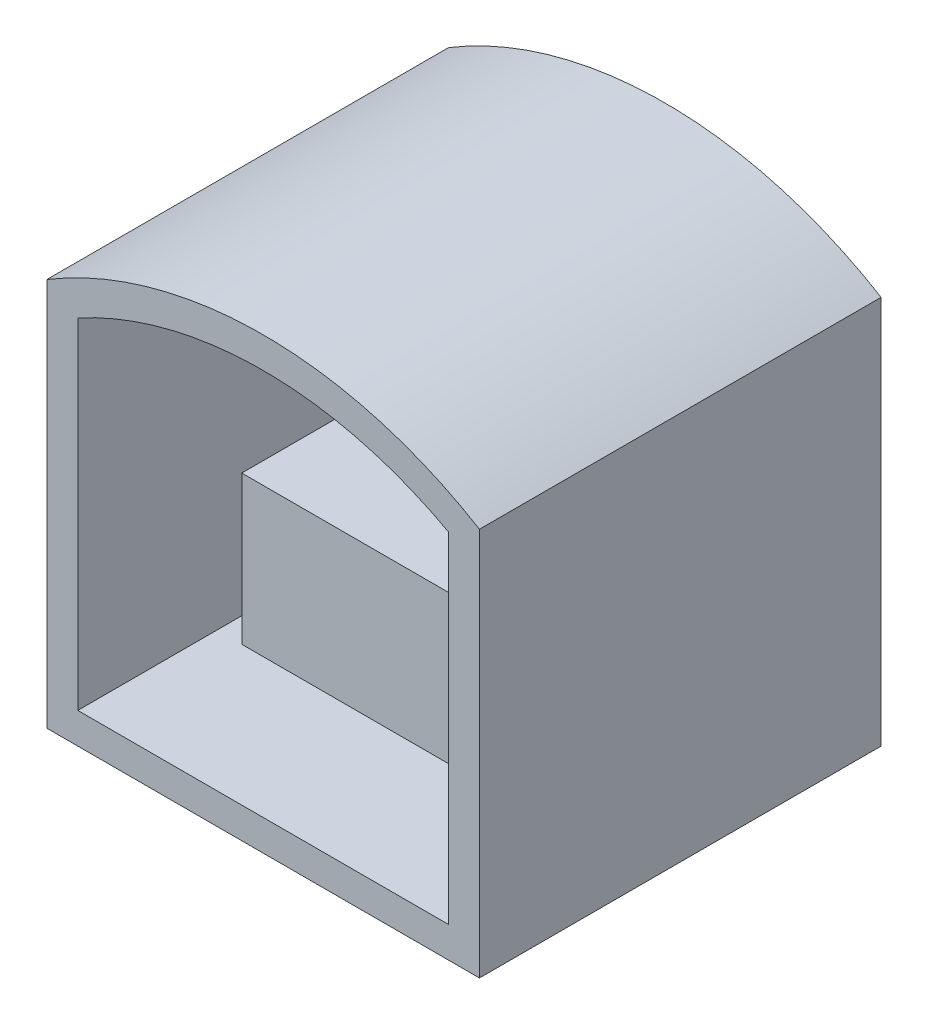
ISO-10303-21;
HEADER;
FILE_DESCRIPTION(('STEP AP214'),'2;1');
FILE_NAME('part.step','',(''),(''),'','','');
FILE_SCHEMA(('AUTOMOTIVE_DESIGN { 1 0 10303 214 1 1 1 1 }'));
ENDSEC;
DATA;
#1=APPLICATION_CONTEXT('core data for automotive mechanical design processes');
#2=APPLICATION_PROTOCOL_DEFINITION('international standard','automotive_design',2000,#1);
#3=PRODUCT_CONTEXT('',#1,'mechanical');
#4=PRODUCT('Part','Part','',(#3));
#5=PRODUCT_RELATED_PRODUCT_CATEGORY('part','',(#4));
#6=PRODUCT_DEFINITION_FORMATION('','',#4);
#7=PRODUCT_DEFINITION_CONTEXT('part definition',#1,'design');
#8=PRODUCT_DEFINITION('design','',#6,#7);
#9=PRODUCT_DEFINITION_SHAPE('','',#8);
#10=(LENGTH_UNIT() NAMED_UNIT(*) SI_UNIT(.MILLI.,.METRE.));
#11=(NAMED_UNIT(*) PLANE_ANGLE_UNIT() SI_UNIT($,.RADIAN.));
#12=(NAMED_UNIT(*) SI_UNIT($,.STERADIAN.) SOLID_ANGLE_UNIT());
#13=UNCERTAINTY_MEASURE_WITH_UNIT(LENGTH_MEASURE(1.E-05),#10,'distance_accuracy_value','');
#14=(GEOMETRIC_REPRESENTATION_CONTEXT(3) GLOBAL_UNCERTAINTY_ASSIGNED_CONTEXT((#13)) GLOBAL_UNIT_ASSIGNED_CONTEXT((#10,
#11,#12)) REPRESENTATION_CONTEXT('',''));
#15=CARTESIAN_POINT('',(0.,0.,0.));
#16=DIRECTION('',(0.,0.,1.));
#17=DIRECTION('',(1.,0.,0.));
#18=AXIS2_PLACEMENT_3D('',#15,#16,#17);
#19=CARTESIAN_POINT('',(242.586252881347,51.9041515967044,147.963821520943));
#20=DIRECTION('',(-1.,0.,0.));
#21=DIRECTION('',(0.,0.,1.));
#22=AXIS2_PLACEMENT_3D('',#19,#20,#21);
#23=PLANE('',#22);
#24=DIRECTION('',(0.,1.,0.));
#25=VECTOR('',#24,1.);
#26=CARTESIAN_POINT('',(242.586252881347,51.9041515967044,17.963821520943));
#27=LINE('',#26,#25);
#28=CARTESIAN_POINT('',(242.586252881347,41.9041515967044,17.963821520943));
#29=VERTEX_POINT('',#28);
#30=CARTESIAN_POINT('',(242.586252881347,167.688402759064,17.963821520943));
#31=VERTEX_POINT('',#30);
#32=EDGE_CURVE('P0_E105',#29,#31,#27,.T.);
#33=ORIENTED_EDGE('',*,*,#32,.T.);
#34=DIRECTION('',(0.,0.,-1.));
#35=VECTOR('',#34,1.);
#36=CARTESIAN_POINT('',(242.586252881347,167.688402759064,147.963821520943));
#37=LINE('',#36,#35);
#38=CARTESIAN_POINT('',(242.586252881347,167.688402759064,147.963821520943));
#39=VERTEX_POINT('',#38);
#40=EDGE_CURVE('P0_E11',#39,#31,#37,.T.);
#41=ORIENTED_EDGE('',*,*,#40,.F.);
#42=DIRECTION('',(0.,1.,0.));
#43=VECTOR('',#42,1.);
#44=CARTESIAN_POINT('',(242.586252881347,51.9041515967044,147.963821520943));
#45=LINE('',#44,#43);
#46=CARTESIAN_POINT('',(242.586252881347,41.9041515967044,147.963821520943));
#47=VERTEX_POINT('',#46);
#48=EDGE_CURVE('P0_E141',#47,#39,#45,.T.);
#49=ORIENTED_EDGE('',*,*,#48,.F.);
#50=DIRECTION('',(0.,0.,-1.));
#51=VECTOR('',#50,1.);
#52=CARTESIAN_POINT('',(242.586252881347,41.9041515967044,147.963821520943));
#53=LINE('',#52,#51);
#54=EDGE_CURVE('P0_E128',#47,#29,#53,.T.);
#55=ORIENTED_EDGE('',*,*,#54,.T.);
#56=EDGE_LOOP('',(#33,#41,#49,#55));
#57=FACE_BOUND('',#56,.T.);
#58=ADVANCED_FACE('P0_F17',(#57),#23,.F.);
#59=CARTESIAN_POINT('',(172.586252881347,51.9041515967044,147.963821520943));
#60=DIRECTION('',(0.,0.,-1.));
#61=DIRECTION('',(-1.,0.,0.));
#62=AXIS2_PLACEMENT_3D('',#59,#60,#61);
#63=CYLINDRICAL_SURFACE('',#62,135.299640861417);
#64=CARTESIAN_POINT('',(172.586252881347,51.9041515967044,17.963821520943));
#65=DIRECTION('',(0.,0.,1.));
#66=DIRECTION('',(1.,0.,0.));
#67=AXIS2_PLACEMENT_3D('',#64,#65,#66);
#68=CIRCLE('',#67,135.299640861417);
#69=CARTESIAN_POINT('',(102.586252881347,167.688402759064,17.963821520943));
#70=VERTEX_POINT('',#69);
#71=EDGE_CURVE('P0_E126',#31,#70,#68,.T.);
#72=ORIENTED_EDGE('',*,*,#71,.T.);
#73=DIRECTION('',(0.,0.,-1.));
#74=VECTOR('',#73,1.);
#75=CARTESIAN_POINT('',(102.586252881347,167.688402759064,147.963821520943));
#76=LINE('',#75,#74);
#77=CARTESIAN_POINT('',(102.586252881347,167.688402759064,147.963821520943));
#78=VERTEX_POINT('',#77);
#79=EDGE_CURVE('P0_E26',#78,#70,#76,.T.);
#80=ORIENTED_EDGE('',*,*,#79,.F.);
#81=CARTESIAN_POINT('',(172.586252881347,51.9041515967044,147.963821520943));
#82=DIRECTION('',(0.,0.,1.));
#83=DIRECTION('',(1.,0.,0.));
#84=AXIS2_PLACEMENT_3D('',#81,#82,#83);
#85=CIRCLE('',#84,135.299640861417);
#86=EDGE_CURVE('P0_E143',#39,#78,#85,.T.);
#87=ORIENTED_EDGE('',*,*,#86,.F.);
#88=ORIENTED_EDGE('',*,*,#40,.T.);
#89=EDGE_LOOP('',(#72,#80,#87,#88));
#90=FACE_BOUND('',#89,.T.);
#91=ADVANCED_FACE('P0_F159',(#90),#63,.T.);
#92=CARTESIAN_POINT('',(102.586252881347,51.9041515967044,147.963821520943));
#93=DIRECTION('',(1.,0.,0.));
#94=DIRECTION('',(0.,0.,-1.));
#95=AXIS2_PLACEMENT_3D('',#92,#93,#94);
#96=PLANE('',#95);
#97=DIRECTION('',(0.,-1.,0.));
#98=VECTOR('',#97,1.);
#99=CARTESIAN_POINT('',(102.586252881347,51.9041515967044,17.963821520943));
#100=LINE('',#99,#98);
#101=CARTESIAN_POINT('',(102.586252881347,41.9041515967044,17.963821520943));
#102=VERTEX_POINT('',#101);
#103=EDGE_CURVE('P0_E133',#70,#102,#100,.T.);
#104=ORIENTED_EDGE('',*,*,#103,.T.);
#105=DIRECTION('',(0.,0.,-1.));
#106=VECTOR('',#105,1.);
#107=CARTESIAN_POINT('',(102.586252881347,41.9041515967044,147.963821520943));
#108=LINE('',#107,#106);
#109=CARTESIAN_POINT('',(102.586252881347,41.9041515967044,147.963821520943));
#110=VERTEX_POINT('',#109);
#111=EDGE_CURVE('P0_E131',#110,#102,#108,.T.);
#112=ORIENTED_EDGE('',*,*,#111,.F.);
#113=DIRECTION('',(0.,-1.,0.));
#114=VECTOR('',#113,1.);
#115=CARTESIAN_POINT('',(102.586252881347,51.9041515967044,147.963821520943));
#116=LINE('',#115,#114);
#117=EDGE_CURVE('P0_E144',#78,#110,#116,.T.);
#118=ORIENTED_EDGE('',*,*,#117,.F.);
#119=ORIENTED_EDGE('',*,*,#79,.T.);
#120=EDGE_LOOP('',(#104,#112,#118,#119));
#121=FACE_BOUND('',#120,.T.);
#122=ADVANCED_FACE('P0_F149',(#121),#96,.F.);
#123=CARTESIAN_POINT('',(232.586252881347,41.9041515967044,147.963821520943));
#124=DIRECTION('',(0.,1.,0.));
#125=DIRECTION('',(-1.,0.,0.));
#126=AXIS2_PLACEMENT_3D('',#123,#124,#125);
#127=PLANE('',#126);
#128=DIRECTION('',(1.,0.,0.));
#129=VECTOR('',#128,1.);
#130=CARTESIAN_POINT('',(232.586252881347,41.9041515967044,17.963821520943));
#131=LINE('',#130,#129);
#132=EDGE_CURVE('P0_E137',#102,#29,#131,.T.);
#133=ORIENTED_EDGE('',*,*,#132,.T.);
#134=ORIENTED_EDGE('',*,*,#54,.F.);
#135=DIRECTION('',(1.,0.,0.));
#136=VECTOR('',#135,1.);
#137=CARTESIAN_POINT('',(232.586252881347,41.9041515967044,147.963821520943));
#138=LINE('',#137,#136);
#139=EDGE_CURVE('P0_E21',#110,#47,#138,.T.);
#140=ORIENTED_EDGE('',*,*,#139,.F.);
#141=ORIENTED_EDGE('',*,*,#111,.T.);
#142=EDGE_LOOP('',(#133,#134,#140,#141));
#143=FACE_BOUND('',#142,.T.);
#144=ADVANCED_FACE('P0_F153',(#143),#127,.F.);
#145=CARTESIAN_POINT('',(172.586252881347,51.9041515967044,147.963821520943));
#146=DIRECTION('',(0.,0.,1.));
#147=DIRECTION('',(1.,0.,0.));
#148=AXIS2_PLACEMENT_3D('',#145,#146,#147);
#149=PLANE('',#148);
#150=DIRECTION('',(0.,1.,0.));
#151=VECTOR('',#150,1.);
#152=CARTESIAN_POINT('',(232.586252881347,51.9041515967044,147.963821520943));
#153=LINE('',#152,#151);
#154=CARTESIAN_POINT('',(232.586252881347,51.9041515967044,147.963821520943));
#155=VERTEX_POINT('',#154);
#156=CARTESIAN_POINT('',(232.586252881347,161.904151596704,147.963821520943));
#157=VERTEX_POINT('',#156);
#158=EDGE_CURVE('P0_E86',#155,#157,#153,.T.);
#159=ORIENTED_EDGE('',*,*,#158,.F.);
#160=DIRECTION('',(1.,0.,0.));
#161=VECTOR('',#160,1.);
#162=CARTESIAN_POINT('',(232.586252881347,51.9041515967044,147.963821520943));
#163=LINE('',#162,#161);
#164=CARTESIAN_POINT('',(112.586252881347,51.9041515967044,147.963821520943));
#165=VERTEX_POINT('',#164);
#166=EDGE_CURVE('P0_E112',#165,#155,#163,.T.);
#167=ORIENTED_EDGE('',*,*,#166,.F.);
#168=DIRECTION('',(0.,-1.,0.));
#169=VECTOR('',#168,1.);
#170=CARTESIAN_POINT('',(112.586252881347,51.9041515967044,147.963821520943));
#171=LINE('',#170,#169);
#172=CARTESIAN_POINT('',(112.586252881347,161.904151596704,147.963821520943));
#173=VERTEX_POINT('',#172);
#174=EDGE_CURVE('P0_E110',#173,#165,#171,.T.);
#175=ORIENTED_EDGE('',*,*,#174,.F.);
#176=CARTESIAN_POINT('',(172.586252881347,51.9041515967044,147.963821520943));
#177=DIRECTION('',(0.,0.,1.));
#178=DIRECTION('',(1.,0.,0.));
#179=AXIS2_PLACEMENT_3D('',#176,#177,#178);
#180=CIRCLE('',#179,125.299640861417);
#181=EDGE_CURVE('P0_E97',#157,#173,#180,.T.);
#182=ORIENTED_EDGE('',*,*,#181,.F.);
#183=EDGE_LOOP('',(#159,#167,#175,#182));
#184=FACE_BOUND('',#183,.T.);
#185=ORIENTED_EDGE('',*,*,#48,.T.);
#186=ORIENTED_EDGE('',*,*,#86,.T.);
#187=ORIENTED_EDGE('',*,*,#117,.T.);
#188=ORIENTED_EDGE('',*,*,#139,.T.);
#189=EDGE_LOOP('',(#185,#186,#187,#188));
#190=FACE_BOUND('',#189,.T.);
#191=ADVANCED_FACE('P0_F109',(#184,#190),#149,.T.);
#192=CARTESIAN_POINT('',(172.586252881347,51.9041515967044,17.963821520943));
#193=DIRECTION('',(0.,0.,1.));
#194=DIRECTION('',(1.,0.,0.));
#195=AXIS2_PLACEMENT_3D('',#192,#193,#194);
#196=PLANE('',#195);
#197=ORIENTED_EDGE('',*,*,#32,.F.);
#198=ORIENTED_EDGE('',*,*,#132,.F.);
#199=ORIENTED_EDGE('',*,*,#103,.F.);
#200=ORIENTED_EDGE('',*,*,#71,.F.);
#201=EDGE_LOOP('',(#197,#198,#199,#200));
#202=FACE_BOUND('',#201,.T.);
#203=ADVANCED_FACE('P0_F19',(#202),#196,.F.);
#204=CARTESIAN_POINT('',(232.586252881347,51.9041515967044,147.963821520943));
#205=DIRECTION('',(-1.,0.,0.));
#206=DIRECTION('',(0.,0.,1.));
#207=AXIS2_PLACEMENT_3D('',#204,#205,#206);
#208=PLANE('',#207);
#209=DIRECTION('',(0.,1.,0.));
#210=VECTOR('',#209,1.);
#211=CARTESIAN_POINT('',(232.586252881347,51.9041515967044,27.9638215209431));
#212=LINE('',#211,#210);
#213=CARTESIAN_POINT('',(232.586252881347,51.9041515967044,27.9638215209431));
#214=VERTEX_POINT('',#213);
#215=CARTESIAN_POINT('',(232.586252881347,161.904151596704,27.9638215209431));
#216=VERTEX_POINT('',#215);
#217=EDGE_CURVE('P0_E116',#214,#216,#212,.T.);
#218=ORIENTED_EDGE('',*,*,#217,.F.);
#219=DIRECTION('',(0.,0.,-1.));
#220=VECTOR('',#219,1.);
#221=CARTESIAN_POINT('',(232.586252881347,51.9041515967044,147.963821520943));
#222=LINE('',#221,#220);
#223=EDGE_CURVE('P0_E93',#155,#214,#222,.T.);
#224=ORIENTED_EDGE('',*,*,#223,.F.);
#225=ORIENTED_EDGE('',*,*,#158,.T.);
#226=DIRECTION('',(0.,0.,-1.));
#227=VECTOR('',#226,1.);
#228=CARTESIAN_POINT('',(232.586252881347,161.904151596704,147.963821520943));
#229=LINE('',#228,#227);
#230=EDGE_CURVE('P0_E90',#157,#216,#229,.T.);
#231=ORIENTED_EDGE('',*,*,#230,.T.);
#232=EDGE_LOOP('',(#218,#224,#225,#231));
#233=FACE_BOUND('',#232,.T.);
#234=ADVANCED_FACE('P0_F89',(#233),#208,.T.);
#235=CARTESIAN_POINT('',(172.586252881347,51.9041515967044,147.963821520943));
#236=DIRECTION('',(0.,0.,-1.));
#237=DIRECTION('',(-1.,0.,0.));
#238=AXIS2_PLACEMENT_3D('',#235,#236,#237);
#239=CYLINDRICAL_SURFACE('',#238,125.299640861417);
#240=CARTESIAN_POINT('',(172.586252881347,51.9041515967044,27.9638215209431));
#241=DIRECTION('',(0.,0.,1.));
#242=DIRECTION('',(1.,0.,0.));
#243=AXIS2_PLACEMENT_3D('',#240,#241,#242);
#244=CIRCLE('',#243,125.299640861417);
#245=CARTESIAN_POINT('',(112.586252881347,161.904151596704,27.9638215209431));
#246=VERTEX_POINT('',#245);
#247=EDGE_CURVE('P0_E104',#216,#246,#244,.T.);
#248=ORIENTED_EDGE('',*,*,#247,.F.);
#249=ORIENTED_EDGE('',*,*,#230,.F.);
#250=ORIENTED_EDGE('',*,*,#181,.T.);
#251=DIRECTION('',(0.,0.,-1.));
#252=VECTOR('',#251,1.);
#253=CARTESIAN_POINT('',(112.586252881347,161.904151596704,147.963821520943));
#254=LINE('',#253,#252);
#255=EDGE_CURVE('P0_E106',#173,#246,#254,.T.);
#256=ORIENTED_EDGE('',*,*,#255,.T.);
#257=EDGE_LOOP('',(#248,#249,#250,#256));
#258=FACE_BOUND('',#257,.T.);
#259=ADVANCED_FACE('P0_F101',(#258),#239,.F.);
#260=CARTESIAN_POINT('',(112.586252881347,51.9041515967044,147.963821520943));
#261=DIRECTION('',(1.,0.,0.));
#262=DIRECTION('',(0.,0.,-1.));
#263=AXIS2_PLACEMENT_3D('',#260,#261,#262);
#264=PLANE('',#263);
#265=DIRECTION('',(0.,-1.,0.));
#266=VECTOR('',#265,1.);
#267=CARTESIAN_POINT('',(112.586252881347,51.9041515967044,27.9638215209431));
#268=LINE('',#267,#266);
#269=CARTESIAN_POINT('',(112.586252881347,51.9041515967044,27.9638215209431));
#270=VERTEX_POINT('',#269);
#271=EDGE_CURVE('P0_E119',#246,#270,#268,.T.);
#272=ORIENTED_EDGE('',*,*,#271,.F.);
#273=ORIENTED_EDGE('',*,*,#255,.F.);
#274=ORIENTED_EDGE('',*,*,#174,.T.);
#275=DIRECTION('',(0.,0.,-1.));
#276=VECTOR('',#275,1.);
#277=CARTESIAN_POINT('',(112.586252881347,51.9041515967044,147.963821520943));
#278=LINE('',#277,#276);
#279=EDGE_CURVE('P0_E34',#165,#270,#278,.T.);
#280=ORIENTED_EDGE('',*,*,#279,.T.);
#281=EDGE_LOOP('',(#272,#273,#274,#280));
#282=FACE_BOUND('',#281,.T.);
#283=ADVANCED_FACE('P0_F210',(#282),#264,.T.);
#284=CARTESIAN_POINT('',(232.586252881347,51.9041515967044,147.963821520943));
#285=DIRECTION('',(0.,1.,0.));
#286=DIRECTION('',(-1.,0.,0.));
#287=AXIS2_PLACEMENT_3D('',#284,#285,#286);
#288=PLANE('',#287);
#289=DIRECTION('',(1.,0.,0.));
#290=VECTOR('',#289,1.);
#291=CARTESIAN_POINT('',(232.586252881347,51.9041515967044,27.9638215209431));
#292=LINE('',#291,#290);
#293=EDGE_CURVE('P0_E98',#270,#214,#292,.T.);
#294=ORIENTED_EDGE('',*,*,#293,.F.);
#295=ORIENTED_EDGE('',*,*,#279,.F.);
#296=ORIENTED_EDGE('',*,*,#166,.T.);
#297=ORIENTED_EDGE('',*,*,#223,.T.);
#298=EDGE_LOOP('',(#294,#295,#296,#297));
#299=FACE_BOUND('',#298,.T.);
#300=ADVANCED_FACE('P0_F219',(#299),#288,.T.);
#301=CARTESIAN_POINT('',(172.586252881347,51.9041515967044,27.9638215209431));
#302=DIRECTION('',(0.,0.,1.));
#303=DIRECTION('',(1.,0.,0.));
#304=AXIS2_PLACEMENT_3D('',#301,#302,#303);
#305=PLANE('',#304);
#306=ORIENTED_EDGE('',*,*,#217,.T.);
#307=ORIENTED_EDGE('',*,*,#247,.T.);
#308=ORIENTED_EDGE('',*,*,#271,.T.);
#309=ORIENTED_EDGE('',*,*,#293,.T.);
#310=EDGE_LOOP('',(#306,#307,#308,#309));
#311=FACE_BOUND('',#310,.T.);
#312=ADVANCED_FACE('P0_F229',(#311),#305,.T.);
#313=CLOSED_SHELL('',(#58,#91,#122,#144,#191,#203,#234,#259,#283,#300,#312));
#314=MANIFOLD_SOLID_BREP('P0_B1',#313);
#315=CARTESIAN_POINT('',(120.586252881347,99.9041515967044,57.8928758676525));
#316=DIRECTION('',(1.,0.,0.));
#317=DIRECTION('',(0.,0.,-1.));
#318=AXIS2_PLACEMENT_3D('',#315,#316,#317);
#319=PLANE('',#318);
#320=DIRECTION('',(0.,0.,1.));
#321=VECTOR('',#320,1.);
#322=CARTESIAN_POINT('',(120.586252881347,51.9041515967044,57.8928758676525));
#323=LINE('',#322,#321);
#324=CARTESIAN_POINT('',(120.586252881347,51.9041515967044,57.8928758676525));
#325=VERTEX_POINT('',#324);
#326=CARTESIAN_POINT('',(120.586252881347,51.9041515967044,102.892875867652));
#327=VERTEX_POINT('',#326);
#328=EDGE_CURVE('P1_E79',#325,#327,#323,.T.);
#329=ORIENTED_EDGE('',*,*,#328,.T.);
#330=DIRECTION('',(0.,-1.,0.));
#331=VECTOR('',#330,1.);
#332=CARTESIAN_POINT('',(120.586252881347,99.9041515967044,102.892875867652));
#333=LINE('',#332,#331);
#334=CARTESIAN_POINT('',(120.586252881347,99.9041515967044,102.892875867652));
#335=VERTEX_POINT('',#334);
#336=EDGE_CURVE('P1_E10',#335,#327,#333,.T.);
#337=ORIENTED_EDGE('',*,*,#336,.F.);
#338=DIRECTION('',(0.,0.,1.));
#339=VECTOR('',#338,1.);
#340=CARTESIAN_POINT('',(120.586252881347,99.9041515967044,57.8928758676525));
#341=LINE('',#340,#339);
#342=CARTESIAN_POINT('',(120.586252881347,99.9041515967044,57.8928758676525));
#343=VERTEX_POINT('',#342);
#344=EDGE_CURVE('P1_E67',#343,#335,#341,.T.);
#345=ORIENTED_EDGE('',*,*,#344,.F.);
#346=DIRECTION('',(0.,-1.,0.));
#347=VECTOR('',#346,1.);
#348=CARTESIAN_POINT('',(120.586252881347,99.9041515967044,57.8928758676525));
#349=LINE('',#348,#347);
#350=EDGE_CURVE('P1_E75',#343,#325,#349,.T.);
#351=ORIENTED_EDGE('',*,*,#350,.T.);
#352=EDGE_LOOP('',(#329,#337,#345,#351));
#353=FACE_BOUND('',#352,.T.);
#354=ADVANCED_FACE('P1_F16',(#353),#319,.F.);
#355=CARTESIAN_POINT('',(120.586252881347,99.9041515967044,102.892875867652));
#356=DIRECTION('',(0.,0.,-1.));
#357=DIRECTION('',(-1.,0.,0.));
#358=AXIS2_PLACEMENT_3D('',#355,#356,#357);
#359=PLANE('',#358);
#360=DIRECTION('',(1.,0.,0.));
#361=VECTOR('',#360,1.);
#362=CARTESIAN_POINT('',(120.586252881347,51.9041515967044,102.892875867652));
#363=LINE('',#362,#361);
#364=CARTESIAN_POINT('',(232.586252881347,51.9041515967044,102.892875867652));
#365=VERTEX_POINT('',#364);
#366=EDGE_CURVE('P1_E71',#327,#365,#363,.T.);
#367=ORIENTED_EDGE('',*,*,#366,.T.);
#368=DIRECTION('',(0.,-1.,0.));
#369=VECTOR('',#368,1.);
#370=CARTESIAN_POINT('',(232.586252881347,99.9041515967044,102.892875867652));
#371=LINE('',#370,#369);
#372=CARTESIAN_POINT('',(232.586252881347,99.9041515967044,102.892875867652));
#373=VERTEX_POINT('',#372);
#374=EDGE_CURVE('P1_E24',#373,#365,#371,.T.);
#375=ORIENTED_EDGE('',*,*,#374,.F.);
#376=DIRECTION('',(1.,0.,0.));
#377=VECTOR('',#376,1.);
#378=CARTESIAN_POINT('',(120.586252881347,99.9041515967044,102.892875867652));
#379=LINE('',#378,#377);
#380=EDGE_CURVE('P1_E62',#335,#373,#379,.T.);
#381=ORIENTED_EDGE('',*,*,#380,.F.);
#382=ORIENTED_EDGE('',*,*,#336,.T.);
#383=EDGE_LOOP('',(#367,#375,#381,#382));
#384=FACE_BOUND('',#383,.T.);
#385=ADVANCED_FACE('P1_F70',(#384),#359,.F.);
#386=CARTESIAN_POINT('',(232.586252881347,99.9041515967044,57.8928758676525));
#387=DIRECTION('',(-1.,0.,0.));
#388=DIRECTION('',(0.,0.,1.));
#389=AXIS2_PLACEMENT_3D('',#386,#387,#388);
#390=PLANE('',#389);
#391=DIRECTION('',(0.,0.,-1.));
#392=VECTOR('',#391,1.);
#393=CARTESIAN_POINT('',(232.586252881347,51.9041515967044,57.8928758676525));
#394=LINE('',#393,#392);
#395=CARTESIAN_POINT('',(232.586252881347,51.9041515967044,57.8928758676525));
#396=VERTEX_POINT('',#395);
#397=EDGE_CURVE('P1_E49',#365,#396,#394,.T.);
#398=ORIENTED_EDGE('',*,*,#397,.T.);
#399=DIRECTION('',(0.,-1.,0.));
#400=VECTOR('',#399,1.);
#401=CARTESIAN_POINT('',(232.586252881347,99.9041515967044,57.8928758676525));
#402=LINE('',#401,#400);
#403=CARTESIAN_POINT('',(232.586252881347,99.9041515967044,57.8928758676525));
#404=VERTEX_POINT('',#403);
#405=EDGE_CURVE('P1_E72',#404,#396,#402,.T.);
#406=ORIENTED_EDGE('',*,*,#405,.F.);
#407=DIRECTION('',(0.,0.,-1.));
#408=VECTOR('',#407,1.);
#409=CARTESIAN_POINT('',(232.586252881347,99.9041515967044,57.8928758676525));
#410=LINE('',#409,#408);
#411=EDGE_CURVE('P1_E65',#373,#404,#410,.T.);
#412=ORIENTED_EDGE('',*,*,#411,.F.);
#413=ORIENTED_EDGE('',*,*,#374,.T.);
#414=EDGE_LOOP('',(#398,#406,#412,#413));
#415=FACE_BOUND('',#414,.T.);
#416=ADVANCED_FACE('P1_F73',(#415),#390,.F.);
#417=CARTESIAN_POINT('',(120.586252881347,99.9041515967044,57.8928758676525));
#418=DIRECTION('',(0.,0.,1.));
#419=DIRECTION('',(1.,0.,0.));
#420=AXIS2_PLACEMENT_3D('',#417,#418,#419);
#421=PLANE('',#420);
#422=DIRECTION('',(-1.,0.,0.));
#423=VECTOR('',#422,1.);
#424=CARTESIAN_POINT('',(120.586252881347,51.9041515967044,57.8928758676525));
#425=LINE('',#424,#423);
#426=EDGE_CURVE('P1_E55',#396,#325,#425,.T.);
#427=ORIENTED_EDGE('',*,*,#426,.T.);
#428=ORIENTED_EDGE('',*,*,#350,.F.);
#429=DIRECTION('',(-1.,0.,0.));
#430=VECTOR('',#429,1.);
#431=CARTESIAN_POINT('',(120.586252881347,99.9041515967044,57.8928758676525));
#432=LINE('',#431,#430);
#433=EDGE_CURVE('P1_E32',#404,#343,#432,.T.);
#434=ORIENTED_EDGE('',*,*,#433,.F.);
#435=ORIENTED_EDGE('',*,*,#405,.T.);
#436=EDGE_LOOP('',(#427,#428,#434,#435));
#437=FACE_BOUND('',#436,.T.);
#438=ADVANCED_FACE('P1_F86',(#437),#421,.F.);
#439=CARTESIAN_POINT('',(176.586252881347,99.9041515967044,80.3928758676525));
#440=DIRECTION('',(0.,1.,0.));
#441=DIRECTION('',(0.,0.,1.));
#442=AXIS2_PLACEMENT_3D('',#439,#440,#441);
#443=PLANE('',#442);
#444=ORIENTED_EDGE('',*,*,#344,.T.);
#445=ORIENTED_EDGE('',*,*,#380,.T.);
#446=ORIENTED_EDGE('',*,*,#411,.T.);
#447=ORIENTED_EDGE('',*,*,#433,.T.);
#448=EDGE_LOOP('',(#444,#445,#446,#447));
#449=FACE_BOUND('',#448,.T.);
#450=ADVANCED_FACE('P1_F63',(#449),#443,.T.);
#451=CARTESIAN_POINT('',(176.586252881347,51.9041515967044,80.3928758676525));
#452=DIRECTION('',(0.,1.,0.));
#453=DIRECTION('',(0.,0.,1.));
#454=AXIS2_PLACEMENT_3D('',#451,#452,#453);
#455=PLANE('',#454);
#456=ORIENTED_EDGE('',*,*,#328,.F.);
#457=ORIENTED_EDGE('',*,*,#426,.F.);
#458=ORIENTED_EDGE('',*,*,#397,.F.);
#459=ORIENTED_EDGE('',*,*,#366,.F.);
#460=EDGE_LOOP('',(#456,#457,#458,#459));
#461=FACE_BOUND('',#460,.T.);
#462=ADVANCED_FACE('P1_F89',(#461),#455,.F.);
#463=CLOSED_SHELL('',(#354,#385,#416,#438,#450,#462));
#464=MANIFOLD_SOLID_BREP('P1_B1',#463);
#465=ADVANCED_BREP_SHAPE_REPRESENTATION('',(#18,#314,#464),#14);
#466=SHAPE_DEFINITION_REPRESENTATION(#9,#465);
ENDSEC;
END-ISO-10303-21;
